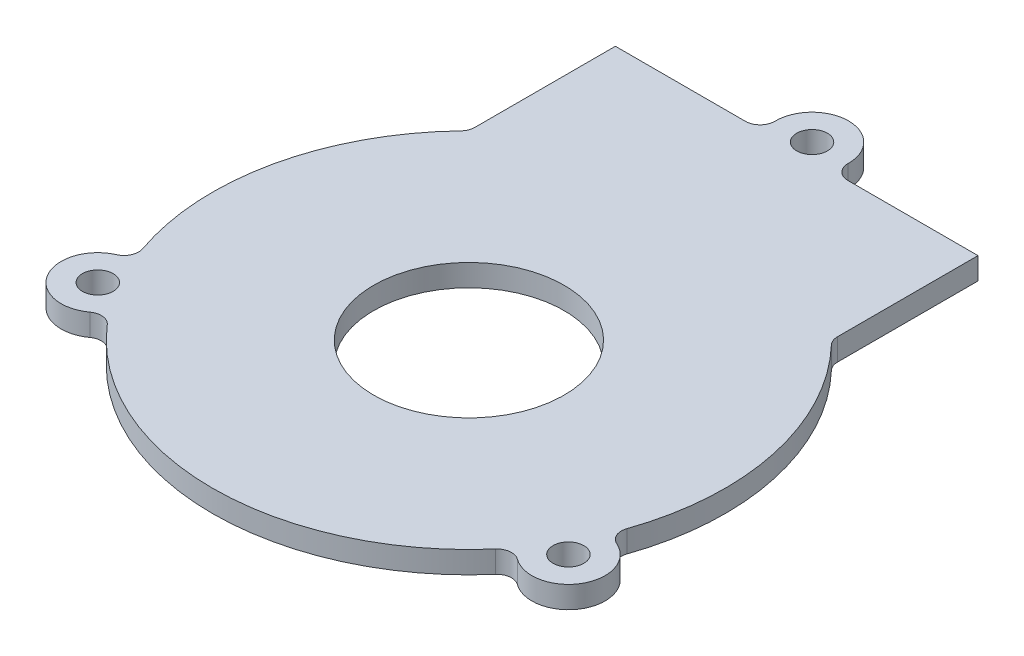
ISO-10303-21;
HEADER;
FILE_DESCRIPTION(('STEP AP214'),'2;1');
FILE_NAME('part.step','',(''),(''),'','','');
FILE_SCHEMA(('AUTOMOTIVE_DESIGN { 1 0 10303 214 1 1 1 1 }'));
ENDSEC;
DATA;
#1=APPLICATION_CONTEXT('core data for automotive mechanical design processes');
#2=APPLICATION_PROTOCOL_DEFINITION('international standard','automotive_design',2000,#1);
#3=PRODUCT_CONTEXT('',#1,'mechanical');
#4=PRODUCT('Part','Part','',(#3));
#5=PRODUCT_RELATED_PRODUCT_CATEGORY('part','',(#4));
#6=PRODUCT_DEFINITION_FORMATION('','',#4);
#7=PRODUCT_DEFINITION_CONTEXT('part definition',#1,'design');
#8=PRODUCT_DEFINITION('design','',#6,#7);
#9=PRODUCT_DEFINITION_SHAPE('','',#8);
#10=(LENGTH_UNIT() NAMED_UNIT(*) SI_UNIT(.MILLI.,.METRE.));
#11=(NAMED_UNIT(*) PLANE_ANGLE_UNIT() SI_UNIT($,.RADIAN.));
#12=(NAMED_UNIT(*) SI_UNIT($,.STERADIAN.) SOLID_ANGLE_UNIT());
#13=UNCERTAINTY_MEASURE_WITH_UNIT(LENGTH_MEASURE(1.E-05),#10,'distance_accuracy_value','');
#14=(GEOMETRIC_REPRESENTATION_CONTEXT(3) GLOBAL_UNCERTAINTY_ASSIGNED_CONTEXT((#13)) GLOBAL_UNIT_ASSIGNED_CONTEXT((#10,
#11,#12)) REPRESENTATION_CONTEXT('',''));
#15=CARTESIAN_POINT('',(0.,0.,0.));
#16=DIRECTION('',(0.,0.,1.));
#17=DIRECTION('',(1.,0.,0.));
#18=AXIS2_PLACEMENT_3D('',#15,#16,#17);
#19=CARTESIAN_POINT('',(0.,3.,0.));
#20=DIRECTION('',(0.,-1.,0.));
#21=DIRECTION('',(0.,0.,-1.));
#22=AXIS2_PLACEMENT_3D('',#19,#20,#21);
#23=CYLINDRICAL_SURFACE('',#22,35.);
#24=CARTESIAN_POINT('',(0.,0.,0.));
#25=DIRECTION('',(0.,1.,0.));
#26=DIRECTION('',(0.,0.,1.));
#27=AXIS2_PLACEMENT_3D('',#24,#25,#26);
#28=CIRCLE('',#27,35.);
#29=CARTESIAN_POINT('',(-25.3019754085747,0.,-24.1828459951239));
#30=VERTEX_POINT('',#29);
#31=CARTESIAN_POINT('',(-33.072840065109,0.,11.4537002766671));
#32=VERTEX_POINT('',#31);
#33=EDGE_CURVE('E211',#30,#32,#28,.T.);
#34=ORIENTED_EDGE('',*,*,#33,.T.);
#35=DIRECTION('',(0.,-1.,0.));
#36=VECTOR('',#35,1.);
#37=CARTESIAN_POINT('',(-33.072840065109,3.,11.4537002766671));
#38=LINE('',#37,#36);
#39=CARTESIAN_POINT('',(-33.072840065109,3.,11.4537002766671));
#40=VERTEX_POINT('',#39);
#41=EDGE_CURVE('E224',#32,#40,#38,.F.);
#42=ORIENTED_EDGE('',*,*,#41,.T.);
#43=CARTESIAN_POINT('',(0.,3.,0.));
#44=DIRECTION('',(0.,1.,0.));
#45=DIRECTION('',(0.,0.,1.));
#46=AXIS2_PLACEMENT_3D('',#43,#44,#45);
#47=CIRCLE('',#46,35.);
#48=CARTESIAN_POINT('',(-25.3019754085747,3.,-24.1828459951239));
#49=VERTEX_POINT('',#48);
#50=EDGE_CURVE('E205',#49,#40,#47,.T.);
#51=ORIENTED_EDGE('',*,*,#50,.F.);
#52=DIRECTION('',(0.,-1.,0.));
#53=VECTOR('',#52,1.);
#54=CARTESIAN_POINT('',(-25.3019754085747,3.,-24.1828459951239));
#55=LINE('',#54,#53);
#56=EDGE_CURVE('E218',#49,#30,#55,.T.);
#57=ORIENTED_EDGE('',*,*,#56,.T.);
#58=EDGE_LOOP('',(#34,#42,#51,#57));
#59=FACE_BOUND('',#58,.T.);
#60=ADVANCED_FACE('F43',(#59),#23,.T.);
#61=CARTESIAN_POINT('',(-26.5021889393046,0.,22.8611894140572));
#62=VERTEX_POINT('',#61);
#63=CARTESIAN_POINT('',(26.4887144081727,0.,22.8768006723464));
#64=VERTEX_POINT('',#63);
#65=EDGE_CURVE('E214',#62,#64,#28,.T.);
#66=ORIENTED_EDGE('',*,*,#65,.T.);
#67=DIRECTION('',(0.,-1.,0.));
#68=VECTOR('',#67,1.);
#69=CARTESIAN_POINT('',(26.4887144081727,3.,22.8768006723464));
#70=LINE('',#69,#68);
#71=CARTESIAN_POINT('',(26.4887144081727,3.,22.8768006723464));
#72=VERTEX_POINT('',#71);
#73=EDGE_CURVE('E243',#64,#72,#70,.F.);
#74=ORIENTED_EDGE('',*,*,#73,.T.);
#75=CARTESIAN_POINT('',(-26.5021889393046,3.,22.8611894140572));
#76=VERTEX_POINT('',#75);
#77=EDGE_CURVE('E209',#76,#72,#47,.T.);
#78=ORIENTED_EDGE('',*,*,#77,.F.);
#79=DIRECTION('',(0.,-1.,0.));
#80=VECTOR('',#79,1.);
#81=CARTESIAN_POINT('',(-26.5021889393046,3.,22.8611894140572));
#82=LINE('',#81,#80);
#83=EDGE_CURVE('E234',#76,#62,#82,.T.);
#84=ORIENTED_EDGE('',*,*,#83,.T.);
#85=EDGE_LOOP('',(#66,#74,#78,#84));
#86=FACE_BOUND('',#85,.T.);
#87=ADVANCED_FACE('F366',(#86),#23,.T.);
#88=CARTESIAN_POINT('',(-24.7478605121482,-53.381962685779,-44.7452325826062));
#89=DIRECTION('',(3.0206381024394E-06,0.,0.999999999995438));
#90=DIRECTION('',(0.999999999995438,0.,-3.0206381024394E-06));
#91=AXIS2_PLACEMENT_3D('',#88,#89,#90);
#92=PLANE('',#91);
#93=DIRECTION('',(0.999999999995438,0.,-3.0206381024394E-06));
#94=VECTOR('',#93,1.);
#95=CARTESIAN_POINT('',(-24.7478605121482,3.,-44.7452325826062));
#96=LINE('',#95,#94);
#97=CARTESIAN_POINT('',(-24.7478605121482,3.,-44.7452325826062));
#98=VERTEX_POINT('',#97);
#99=CARTESIAN_POINT('',(-6.99532394188785,3.,-44.7452862065945));
#100=VERTEX_POINT('',#99);
#101=EDGE_CURVE('E177',#98,#100,#96,.T.);
#102=ORIENTED_EDGE('',*,*,#101,.T.);
#103=DIRECTION('',(0.,1.,0.));
#104=VECTOR('',#103,1.);
#105=CARTESIAN_POINT('',(-6.99532394188785,-53.381962685779,-44.7452862065945));
#106=LINE('',#105,#104);
#107=CARTESIAN_POINT('',(-6.99532394188785,0.,-44.7452862065945));
#108=VERTEX_POINT('',#107);
#109=EDGE_CURVE('E278',#100,#108,#106,.F.);
#110=ORIENTED_EDGE('',*,*,#109,.T.);
#111=DIRECTION('',(-0.999999999995438,0.,3.0206381024394E-06));
#112=VECTOR('',#111,1.);
#113=CARTESIAN_POINT('',(-24.7478605121482,0.,-44.7452325826062));
#114=LINE('',#113,#112);
#115=CARTESIAN_POINT('',(-24.7478605121482,0.,-44.7452325826062));
#116=VERTEX_POINT('',#115);
#117=EDGE_CURVE('E198',#108,#116,#114,.T.);
#118=ORIENTED_EDGE('',*,*,#117,.T.);
#119=DIRECTION('',(0.,1.,0.));
#120=VECTOR('',#119,1.);
#121=CARTESIAN_POINT('',(-24.7478605121482,-53.381962685779,-44.7452325826062));
#122=LINE('',#121,#120);
#123=EDGE_CURVE('E194',#116,#98,#122,.T.);
#124=ORIENTED_EDGE('',*,*,#123,.T.);
#125=EDGE_LOOP('',(#102,#110,#118,#124));
#126=FACE_BOUND('',#125,.T.);
#127=ADVANCED_FACE('F284',(#126),#92,.F.);
#128=CARTESIAN_POINT('',(33.0630730181294,0.,11.4818640733046));
#129=VERTEX_POINT('',#128);
#130=CARTESIAN_POINT('',(25.3018293128609,0.,-24.1829988509046));
#131=VERTEX_POINT('',#130);
#132=EDGE_CURVE('E215',#129,#131,#28,.T.);
#133=ORIENTED_EDGE('',*,*,#132,.T.);
#134=DIRECTION('',(0.,-1.,0.));
#135=VECTOR('',#134,1.);
#136=CARTESIAN_POINT('',(25.3018293128609,3.,-24.1829988509046));
#137=LINE('',#136,#135);
#138=CARTESIAN_POINT('',(25.3018293128609,3.,-24.1829988509046));
#139=VERTEX_POINT('',#138);
#140=EDGE_CURVE('E262',#131,#139,#137,.F.);
#141=ORIENTED_EDGE('',*,*,#140,.T.);
#142=CARTESIAN_POINT('',(33.0630730181294,3.,11.4818640733046));
#143=VERTEX_POINT('',#142);
#144=EDGE_CURVE('E210',#143,#139,#47,.T.);
#145=ORIENTED_EDGE('',*,*,#144,.F.);
#146=DIRECTION('',(0.,-1.,0.));
#147=VECTOR('',#146,1.);
#148=CARTESIAN_POINT('',(33.0630730181294,3.,11.4818640733046));
#149=LINE('',#148,#147);
#150=EDGE_CURVE('E253',#143,#129,#149,.T.);
#151=ORIENTED_EDGE('',*,*,#150,.T.);
#152=EDGE_LOOP('',(#133,#141,#145,#151));
#153=FACE_BOUND('',#152,.T.);
#154=ADVANCED_FACE('F343',(#153),#23,.T.);
#155=CARTESIAN_POINT('',(0.,3.,0.));
#156=DIRECTION('',(0.,1.,0.));
#157=DIRECTION('',(0.,0.,1.));
#158=AXIS2_PLACEMENT_3D('',#155,#156,#157);
#159=PLANE('',#158);
#160=CARTESIAN_POINT('',(0.,3.,0.));
#161=DIRECTION('',(0.,1.,0.));
#162=DIRECTION('',(0.,0.,1.));
#163=AXIS2_PLACEMENT_3D('',#160,#161,#162);
#164=CIRCLE('',#163,13.);
#165=CARTESIAN_POINT('',(0.,3.,13.));
#166=VERTEX_POINT('',#165);
#167=EDGE_CURVE('E335',#166,#166,#164,.T.);
#168=ORIENTED_EDGE('',*,*,#167,.F.);
#169=EDGE_LOOP('',(#168));
#170=FACE_BOUND('',#169,.T.);
#171=CARTESIAN_POINT('',(-32.1480166138315,3.,18.5087961651664));
#172=DIRECTION('',(0.,1.,0.));
#173=DIRECTION('',(0.,0.,1.));
#174=AXIS2_PLACEMENT_3D('',#171,#172,#173);
#175=CIRCLE('',#174,2.09999999999999);
#176=CARTESIAN_POINT('',(-32.1480166138315,3.,20.6087961651664));
#177=VERTEX_POINT('',#176);
#178=EDGE_CURVE('E329',#177,#177,#175,.T.);
#179=ORIENTED_EDGE('',*,*,#178,.F.);
#180=EDGE_LOOP('',(#179));
#181=FACE_BOUND('',#180,.T.);
#182=DIRECTION('',(-3.02063810260161E-06,0.,-0.999999999995438));
#183=VECTOR('',#182,1.);
#184=CARTESIAN_POINT('',(-24.7478001128037,3.,-24.7496745347634));
#185=LINE('',#184,#183);
#186=CARTESIAN_POINT('',(-24.7478025747881,3.,-25.5647289504072));
#187=VERTEX_POINT('',#186);
#188=EDGE_CURVE('E195',#187,#98,#185,.T.);
#189=ORIENTED_EDGE('',*,*,#188,.F.);
#190=CARTESIAN_POINT('',(-26.747802574779,3.,-25.564722909131));
#191=DIRECTION('',(0.,1.,0.));
#192=DIRECTION('',(0.,0.,1.));
#193=AXIS2_PLACEMENT_3D('',#190,#191,#192);
#194=CIRCLE('',#193,2.);
#195=EDGE_CURVE('E220',#187,#49,#194,.F.);
#196=ORIENTED_EDGE('',*,*,#195,.T.);
#197=ORIENTED_EDGE('',*,*,#50,.T.);
#198=CARTESIAN_POINT('',(-34.9627166402581,3.,12.1081974353338));
#199=DIRECTION('',(0.,1.,0.));
#200=DIRECTION('',(0.,0.,1.));
#201=AXIS2_PLACEMENT_3D('',#198,#199,#200);
#202=CIRCLE('',#201,2.);
#203=CARTESIAN_POINT('',(-34.1580179965192,3.,13.9391698799011));
#204=VERTEX_POINT('',#203);
#205=EDGE_CURVE('E230',#40,#204,#202,.F.);
#206=ORIENTED_EDGE('',*,*,#205,.T.);
#207=CARTESIAN_POINT('',(-32.1464555555357,3.,18.5161819435163));
#208=DIRECTION('',(0.,1.,0.));
#209=DIRECTION('',(0.,0.,1.));
#210=AXIS2_PLACEMENT_3D('',#207,#208,#209);
#211=CIRCLE('',#210,4.99954226749351);
#212=CARTESIAN_POINT('',(-29.1966357044392,3.,22.5527628891349));
#213=VERTEX_POINT('',#212);
#214=EDGE_CURVE('E323',#204,#213,#211,.T.);
#215=ORIENTED_EDGE('',*,*,#214,.T.);
#216=CARTESIAN_POINT('',(-28.0165997358363,3.,24.1675430948605));
#217=DIRECTION('',(0.,1.,0.));
#218=DIRECTION('',(0.,0.,1.));
#219=AXIS2_PLACEMENT_3D('',#216,#217,#218);
#220=CIRCLE('',#219,2.);
#221=EDGE_CURVE('E241',#213,#76,#220,.F.);
#222=ORIENTED_EDGE('',*,*,#221,.T.);
#223=ORIENTED_EDGE('',*,*,#77,.T.);
#224=CARTESIAN_POINT('',(28.0023552314968,3.,24.1840464250519));
#225=DIRECTION('',(0.,1.,0.));
#226=DIRECTION('',(0.,0.,1.));
#227=AXIS2_PLACEMENT_3D('',#224,#225,#226);
#228=CIRCLE('',#227,2.);
#229=CARTESIAN_POINT('',(29.184359284545,3.,22.5707062815676));
#230=VERTEX_POINT('',#229);
#231=EDGE_CURVE('E249',#72,#230,#228,.F.);
#232=ORIENTED_EDGE('',*,*,#231,.T.);
#233=CARTESIAN_POINT('',(32.1364886347761,3.,18.5412879583363));
#234=DIRECTION('',(0.,1.,0.));
#235=DIRECTION('',(0.,0.,1.));
#236=AXIS2_PLACEMENT_3D('',#233,#234,#235);
#237=CIRCLE('',#236,4.9951255964279);
#238=CARTESIAN_POINT('',(34.147287178261,3.,13.9687647007018));
#239=VERTEX_POINT('',#238);
#240=EDGE_CURVE('E312',#230,#239,#237,.T.);
#241=ORIENTED_EDGE('',*,*,#240,.T.);
#242=CARTESIAN_POINT('',(34.9523914763083,3.,12.1379705917791));
#243=DIRECTION('',(0.,1.,0.));
#244=DIRECTION('',(0.,0.,1.));
#245=AXIS2_PLACEMENT_3D('',#242,#243,#244);
#246=CIRCLE('',#245,2.);
#247=EDGE_CURVE('E260',#239,#143,#246,.F.);
#248=ORIENTED_EDGE('',*,*,#247,.T.);
#249=ORIENTED_EDGE('',*,*,#144,.T.);
#250=CARTESIAN_POINT('',(26.7476481307387,3.,-25.5648844995277));
#251=DIRECTION('',(0.,1.,0.));
#252=DIRECTION('',(0.,0.,1.));
#253=AXIS2_PLACEMENT_3D('',#250,#251,#252);
#254=CIRCLE('',#253,2.);
#255=CARTESIAN_POINT('',(24.7476481307478,3.,-25.5648784582515));
#256=VERTEX_POINT('',#255);
#257=EDGE_CURVE('E185',#139,#256,#254,.F.);
#258=ORIENTED_EDGE('',*,*,#257,.T.);
#259=DIRECTION('',(-3.02063810260161E-06,0.,-0.999999999995438));
#260=VECTOR('',#259,1.);
#261=CARTESIAN_POINT('',(24.7476505927322,3.,-24.7498240426077));
#262=LINE('',#261,#260);
#263=CARTESIAN_POINT('',(24.7475901933877,3.,-44.7453820904505));
#264=VERTEX_POINT('',#263);
#265=EDGE_CURVE('E178',#256,#264,#262,.T.);
#266=ORIENTED_EDGE('',*,*,#265,.T.);
#267=CARTESIAN_POINT('',(6.99533660471705,3.,-44.7453284673169));
#268=VERTEX_POINT('',#267);
#269=EDGE_CURVE('E168',#268,#264,#96,.T.);
#270=ORIENTED_EDGE('',*,*,#269,.F.);
#271=CARTESIAN_POINT('',(6.99533056344084,3.,-46.7453284673078));
#272=DIRECTION('',(0.,1.,0.));
#273=DIRECTION('',(0.,0.,1.));
#274=AXIS2_PLACEMENT_3D('',#271,#272,#273);
#275=CIRCLE('',#274,2.);
#276=CARTESIAN_POINT('',(4.99551899083441,3.,-46.7727815922561));
#277=VERTEX_POINT('',#276);
#278=EDGE_CURVE('E274',#268,#277,#275,.F.);
#279=ORIENTED_EDGE('',*,*,#278,.T.);
#280=CARTESIAN_POINT('',(0.,3.,-46.8413593567393));
#281=DIRECTION('',(0.,1.,0.));
#282=DIRECTION('',(0.,0.,1.));
#283=AXIS2_PLACEMENT_3D('',#280,#281,#282);
#284=CIRCLE('',#283,4.99598968149142);
#285=CARTESIAN_POINT('',(-4.99551857644603,3.,-46.7727514129473));
#286=VERTEX_POINT('',#285);
#287=EDGE_CURVE('E304',#277,#286,#284,.T.);
#288=ORIENTED_EDGE('',*,*,#287,.T.);
#289=CARTESIAN_POINT('',(-6.99532998316405,3.,-46.7452862065854));
#290=DIRECTION('',(0.,1.,0.));
#291=DIRECTION('',(0.,0.,1.));
#292=AXIS2_PLACEMENT_3D('',#289,#290,#291);
#293=CIRCLE('',#292,2.);
#294=EDGE_CURVE('E12',#286,#100,#293,.F.);
#295=ORIENTED_EDGE('',*,*,#294,.T.);
#296=ORIENTED_EDGE('',*,*,#101,.F.);
#297=EDGE_LOOP('',(#189,#196,#197,#206,#215,#222,#223,#232,#241,#248,#249,#258,#266,#270,#279,
#288,#295,#296));
#298=FACE_BOUND('',#297,.T.);
#299=CARTESIAN_POINT('',(32.1247811991366,3.,18.5356173256723));
#300=DIRECTION('',(0.,1.,0.));
#301=DIRECTION('',(0.,0.,1.));
#302=AXIS2_PLACEMENT_3D('',#299,#300,#301);
#303=CIRCLE('',#302,2.1);
#304=CARTESIAN_POINT('',(32.1247811991366,3.,20.6356173256723));
#305=VERTEX_POINT('',#304);
#306=EDGE_CURVE('E318',#305,#305,#303,.T.);
#307=ORIENTED_EDGE('',*,*,#306,.F.);
#308=EDGE_LOOP('',(#307));
#309=FACE_BOUND('',#308,.T.);
#310=CARTESIAN_POINT('',(0.,3.,-46.8413593567393));
#311=DIRECTION('',(0.,1.,0.));
#312=DIRECTION('',(0.,0.,1.));
#313=AXIS2_PLACEMENT_3D('',#310,#311,#312);
#314=CIRCLE('',#313,2.09605202456873);
#315=CARTESIAN_POINT('',(0.,3.,-44.7453073321706));
#316=VERTEX_POINT('',#315);
#317=EDGE_CURVE('E306',#316,#316,#314,.T.);
#318=ORIENTED_EDGE('',*,*,#317,.F.);
#319=EDGE_LOOP('',(#318));
#320=FACE_BOUND('',#319,.T.);
#321=ADVANCED_FACE('F182',(#170,#181,#298,#309,#320),#159,.T.);
#322=CARTESIAN_POINT('',(0.,0.,0.));
#323=DIRECTION('',(0.,1.,0.));
#324=DIRECTION('',(0.,0.,1.));
#325=AXIS2_PLACEMENT_3D('',#322,#323,#324);
#326=PLANE('',#325);
#327=CARTESIAN_POINT('',(0.,0.,0.));
#328=DIRECTION('',(0.,1.,0.));
#329=DIRECTION('',(0.,0.,1.));
#330=AXIS2_PLACEMENT_3D('',#327,#328,#329);
#331=CIRCLE('',#330,13.);
#332=CARTESIAN_POINT('',(0.,0.,13.));
#333=VERTEX_POINT('',#332);
#334=EDGE_CURVE('E332',#333,#333,#331,.F.);
#335=ORIENTED_EDGE('',*,*,#334,.F.);
#336=EDGE_LOOP('',(#335));
#337=FACE_BOUND('',#336,.T.);
#338=CARTESIAN_POINT('',(-32.1480166138315,0.,18.5087961651664));
#339=DIRECTION('',(0.,1.,0.));
#340=DIRECTION('',(0.,0.,1.));
#341=AXIS2_PLACEMENT_3D('',#338,#339,#340);
#342=CIRCLE('',#341,2.1);
#343=CARTESIAN_POINT('',(-32.1480166138315,0.,20.6087961651664));
#344=VERTEX_POINT('',#343);
#345=EDGE_CURVE('E326',#344,#344,#342,.T.);
#346=ORIENTED_EDGE('',*,*,#345,.T.);
#347=EDGE_LOOP('',(#346));
#348=FACE_BOUND('',#347,.T.);
#349=CARTESIAN_POINT('',(32.1247811991366,0.,18.5356173256723));
#350=DIRECTION('',(0.,1.,0.));
#351=DIRECTION('',(0.,0.,1.));
#352=AXIS2_PLACEMENT_3D('',#349,#350,#351);
#353=CIRCLE('',#352,2.1);
#354=CARTESIAN_POINT('',(32.1247811991366,0.,20.6356173256723));
#355=VERTEX_POINT('',#354);
#356=EDGE_CURVE('E315',#355,#355,#353,.T.);
#357=ORIENTED_EDGE('',*,*,#356,.T.);
#358=EDGE_LOOP('',(#357));
#359=FACE_BOUND('',#358,.T.);
#360=CARTESIAN_POINT('',(0.,0.,-46.8413593567393));
#361=DIRECTION('',(0.,1.,0.));
#362=DIRECTION('',(0.,0.,1.));
#363=AXIS2_PLACEMENT_3D('',#360,#361,#362);
#364=CIRCLE('',#363,2.09605202456873);
#365=CARTESIAN_POINT('',(0.,0.,-44.7453073321706));
#366=VERTEX_POINT('',#365);
#367=EDGE_CURVE('E188',#366,#366,#364,.F.);
#368=ORIENTED_EDGE('',*,*,#367,.F.);
#369=EDGE_LOOP('',(#368));
#370=FACE_BOUND('',#369,.T.);
#371=ORIENTED_EDGE('',*,*,#65,.F.);
#372=CARTESIAN_POINT('',(-28.0165997358363,0.,24.1675430948605));
#373=DIRECTION('',(0.,1.,0.));
#374=DIRECTION('',(0.,0.,1.));
#375=AXIS2_PLACEMENT_3D('',#372,#373,#374);
#376=CIRCLE('',#375,2.);
#377=CARTESIAN_POINT('',(-29.1966357044392,0.,22.5527628891349));
#378=VERTEX_POINT('',#377);
#379=EDGE_CURVE('E239',#62,#378,#376,.T.);
#380=ORIENTED_EDGE('',*,*,#379,.T.);
#381=CARTESIAN_POINT('',(-32.1464555555357,0.,18.5161819435163));
#382=DIRECTION('',(0.,1.,0.));
#383=DIRECTION('',(0.,0.,1.));
#384=AXIS2_PLACEMENT_3D('',#381,#382,#383);
#385=CIRCLE('',#384,4.99954226749351);
#386=CARTESIAN_POINT('',(-34.1580179965192,0.,13.9391698799011));
#387=VERTEX_POINT('',#386);
#388=EDGE_CURVE('E321',#378,#387,#385,.F.);
#389=ORIENTED_EDGE('',*,*,#388,.T.);
#390=CARTESIAN_POINT('',(-34.9627166402581,0.,12.1081974353338));
#391=DIRECTION('',(0.,1.,0.));
#392=DIRECTION('',(0.,0.,1.));
#393=AXIS2_PLACEMENT_3D('',#390,#391,#392);
#394=CIRCLE('',#393,2.);
#395=EDGE_CURVE('E232',#387,#32,#394,.T.);
#396=ORIENTED_EDGE('',*,*,#395,.T.);
#397=ORIENTED_EDGE('',*,*,#33,.F.);
#398=CARTESIAN_POINT('',(-26.747802574779,0.,-25.564722909131));
#399=DIRECTION('',(0.,1.,0.));
#400=DIRECTION('',(0.,0.,1.));
#401=AXIS2_PLACEMENT_3D('',#398,#399,#400);
#402=CIRCLE('',#401,2.);
#403=CARTESIAN_POINT('',(-24.7478025747881,0.,-25.5647289504072));
#404=VERTEX_POINT('',#403);
#405=EDGE_CURVE('E222',#30,#404,#402,.T.);
#406=ORIENTED_EDGE('',*,*,#405,.T.);
#407=DIRECTION('',(3.02063810260161E-06,0.,0.999999999995438));
#408=VECTOR('',#407,1.);
#409=CARTESIAN_POINT('',(-24.7478001128037,0.,-24.7496745347634));
#410=LINE('',#409,#408);
#411=EDGE_CURVE('E204',#116,#404,#410,.T.);
#412=ORIENTED_EDGE('',*,*,#411,.F.);
#413=ORIENTED_EDGE('',*,*,#117,.F.);
#414=CARTESIAN_POINT('',(-6.99532998316405,0.,-46.7452862065854));
#415=DIRECTION('',(0.,1.,0.));
#416=DIRECTION('',(0.,0.,1.));
#417=AXIS2_PLACEMENT_3D('',#414,#415,#416);
#418=CIRCLE('',#417,2.);
#419=CARTESIAN_POINT('',(-4.99551857644603,0.,-46.7727514129473));
#420=VERTEX_POINT('',#419);
#421=EDGE_CURVE('E51',#108,#420,#418,.T.);
#422=ORIENTED_EDGE('',*,*,#421,.T.);
#423=CARTESIAN_POINT('',(0.,0.,-46.8413593567393));
#424=DIRECTION('',(0.,1.,0.));
#425=DIRECTION('',(0.,0.,1.));
#426=AXIS2_PLACEMENT_3D('',#423,#424,#425);
#427=CIRCLE('',#426,4.99598968149142);
#428=CARTESIAN_POINT('',(4.99551899083441,0.,-46.7727815922561));
#429=VERTEX_POINT('',#428);
#430=EDGE_CURVE('E303',#420,#429,#427,.F.);
#431=ORIENTED_EDGE('',*,*,#430,.T.);
#432=CARTESIAN_POINT('',(6.99533056344084,0.,-46.7453284673078));
#433=DIRECTION('',(0.,1.,0.));
#434=DIRECTION('',(0.,0.,1.));
#435=AXIS2_PLACEMENT_3D('',#432,#433,#434);
#436=CIRCLE('',#435,2.);
#437=CARTESIAN_POINT('',(6.99533660471705,0.,-44.7453284673169));
#438=VERTEX_POINT('',#437);
#439=EDGE_CURVE('E276',#429,#438,#436,.T.);
#440=ORIENTED_EDGE('',*,*,#439,.T.);
#441=CARTESIAN_POINT('',(24.7475901933877,0.,-44.7453820904505));
#442=VERTEX_POINT('',#441);
#443=EDGE_CURVE('E202',#442,#438,#114,.T.);
#444=ORIENTED_EDGE('',*,*,#443,.F.);
#445=DIRECTION('',(3.02063810260161E-06,0.,0.999999999995438));
#446=VECTOR('',#445,1.);
#447=CARTESIAN_POINT('',(24.7476505927322,0.,-24.7498240426077));
#448=LINE('',#447,#446);
#449=CARTESIAN_POINT('',(24.7476481307478,0.,-25.5648784582515));
#450=VERTEX_POINT('',#449);
#451=EDGE_CURVE('E193',#442,#450,#448,.T.);
#452=ORIENTED_EDGE('',*,*,#451,.T.);
#453=CARTESIAN_POINT('',(26.7476481307387,0.,-25.5648844995277));
#454=DIRECTION('',(0.,1.,0.));
#455=DIRECTION('',(0.,0.,1.));
#456=AXIS2_PLACEMENT_3D('',#453,#454,#455);
#457=CIRCLE('',#456,2.);
#458=EDGE_CURVE('E268',#450,#131,#457,.T.);
#459=ORIENTED_EDGE('',*,*,#458,.T.);
#460=ORIENTED_EDGE('',*,*,#132,.F.);
#461=CARTESIAN_POINT('',(34.9523914763083,0.,12.1379705917791));
#462=DIRECTION('',(0.,1.,0.));
#463=DIRECTION('',(0.,0.,1.));
#464=AXIS2_PLACEMENT_3D('',#461,#462,#463);
#465=CIRCLE('',#464,2.);
#466=CARTESIAN_POINT('',(34.147287178261,0.,13.9687647007018));
#467=VERTEX_POINT('',#466);
#468=EDGE_CURVE('E258',#129,#467,#465,.T.);
#469=ORIENTED_EDGE('',*,*,#468,.T.);
#470=CARTESIAN_POINT('',(32.1364886347761,0.,18.5412879583363));
#471=DIRECTION('',(0.,1.,0.));
#472=DIRECTION('',(0.,0.,1.));
#473=AXIS2_PLACEMENT_3D('',#470,#471,#472);
#474=CIRCLE('',#473,4.9951255964279);
#475=CARTESIAN_POINT('',(29.184359284545,0.,22.5707062815676));
#476=VERTEX_POINT('',#475);
#477=EDGE_CURVE('E309',#467,#476,#474,.F.);
#478=ORIENTED_EDGE('',*,*,#477,.T.);
#479=CARTESIAN_POINT('',(28.0023552314968,0.,24.1840464250519));
#480=DIRECTION('',(0.,1.,0.));
#481=DIRECTION('',(0.,0.,1.));
#482=AXIS2_PLACEMENT_3D('',#479,#480,#481);
#483=CIRCLE('',#482,2.);
#484=EDGE_CURVE('E251',#476,#64,#483,.T.);
#485=ORIENTED_EDGE('',*,*,#484,.T.);
#486=EDGE_LOOP('',(#371,#380,#389,#396,#397,#406,#412,#413,#422,#431,#440,#444,#452,#459,#460,
#469,#478,#485));
#487=FACE_BOUND('',#486,.T.);
#488=ADVANCED_FACE('F290',(#337,#348,#359,#370,#487),#326,.F.);
#489=ORIENTED_EDGE('',*,*,#443,.T.);
#490=DIRECTION('',(0.,1.,0.));
#491=VECTOR('',#490,1.);
#492=CARTESIAN_POINT('',(6.99533660471705,-53.381962685779,-44.7453284673169));
#493=LINE('',#492,#491);
#494=EDGE_CURVE('E175',#438,#268,#493,.T.);
#495=ORIENTED_EDGE('',*,*,#494,.T.);
#496=ORIENTED_EDGE('',*,*,#269,.T.);
#497=DIRECTION('',(0.,1.,0.));
#498=VECTOR('',#497,1.);
#499=CARTESIAN_POINT('',(24.7475901933877,-53.381962685779,-44.7453820904505));
#500=LINE('',#499,#498);
#501=EDGE_CURVE('E173',#442,#264,#500,.T.);
#502=ORIENTED_EDGE('',*,*,#501,.F.);
#503=EDGE_LOOP('',(#489,#495,#496,#502));
#504=FACE_BOUND('',#503,.T.);
#505=ADVANCED_FACE('F171',(#504),#92,.F.);
#506=CARTESIAN_POINT('',(-24.7478001128037,-53.381962685779,-24.7496745347634));
#507=DIRECTION('',(0.999999999995438,0.,-3.02063810260161E-06));
#508=DIRECTION('',(-3.02063810260161E-06,0.,-0.999999999995438));
#509=AXIS2_PLACEMENT_3D('',#506,#507,#508);
#510=PLANE('',#509);
#511=ORIENTED_EDGE('',*,*,#411,.T.);
#512=DIRECTION('',(0.,1.,0.));
#513=VECTOR('',#512,1.);
#514=CARTESIAN_POINT('',(-24.7478025747881,3.,-25.5647289504072));
#515=LINE('',#514,#513);
#516=EDGE_CURVE('E208',#404,#187,#515,.T.);
#517=ORIENTED_EDGE('',*,*,#516,.T.);
#518=ORIENTED_EDGE('',*,*,#188,.T.);
#519=ORIENTED_EDGE('',*,*,#123,.F.);
#520=EDGE_LOOP('',(#511,#517,#518,#519));
#521=FACE_BOUND('',#520,.T.);
#522=ADVANCED_FACE('F298',(#521),#510,.F.);
#523=CARTESIAN_POINT('',(24.7476505927322,-53.381962685779,-24.7498240426077));
#524=DIRECTION('',(0.999999999995438,0.,-3.02063810260161E-06));
#525=DIRECTION('',(-3.02063810260161E-06,0.,-0.999999999995438));
#526=AXIS2_PLACEMENT_3D('',#523,#524,#525);
#527=PLANE('',#526);
#528=ORIENTED_EDGE('',*,*,#265,.F.);
#529=DIRECTION('',(0.,-1.,0.));
#530=VECTOR('',#529,1.);
#531=CARTESIAN_POINT('',(24.7476481307478,-53.381962685779,-25.5648784582515));
#532=LINE('',#531,#530);
#533=EDGE_CURVE('E265',#256,#450,#532,.T.);
#534=ORIENTED_EDGE('',*,*,#533,.T.);
#535=ORIENTED_EDGE('',*,*,#451,.F.);
#536=ORIENTED_EDGE('',*,*,#501,.T.);
#537=EDGE_LOOP('',(#528,#534,#535,#536));
#538=FACE_BOUND('',#537,.T.);
#539=ADVANCED_FACE('F191',(#538),#527,.T.);
#540=CARTESIAN_POINT('',(0.,-14.1307927300824,-46.8413593567393));
#541=DIRECTION('',(0.,1.,0.));
#542=DIRECTION('',(0.,0.,1.));
#543=AXIS2_PLACEMENT_3D('',#540,#541,#542);
#544=CYLINDRICAL_SURFACE('',#543,4.99598968149142);
#545=ORIENTED_EDGE('',*,*,#430,.F.);
#546=DIRECTION('',(0.,1.,0.));
#547=VECTOR('',#546,1.);
#548=CARTESIAN_POINT('',(-4.99551857644604,-14.1307927300824,-46.7727514129473));
#549=LINE('',#548,#547);
#550=EDGE_CURVE('E64',#420,#286,#549,.T.);
#551=ORIENTED_EDGE('',*,*,#550,.T.);
#552=ORIENTED_EDGE('',*,*,#287,.F.);
#553=DIRECTION('',(0.,1.,0.));
#554=VECTOR('',#553,1.);
#555=CARTESIAN_POINT('',(4.99551899083441,-14.1307927300824,-46.7727815922561));
#556=LINE('',#555,#554);
#557=EDGE_CURVE('E271',#277,#429,#556,.F.);
#558=ORIENTED_EDGE('',*,*,#557,.T.);
#559=EDGE_LOOP('',(#545,#551,#552,#558));
#560=FACE_BOUND('',#559,.T.);
#561=ADVANCED_FACE('F392',(#560),#544,.T.);
#562=CARTESIAN_POINT('',(0.,-14.1307927300824,-46.8413593567393));
#563=DIRECTION('',(0.,1.,0.));
#564=DIRECTION('',(0.,0.,1.));
#565=AXIS2_PLACEMENT_3D('',#562,#563,#564);
#566=CYLINDRICAL_SURFACE('',#565,2.09605202456873);
#567=ORIENTED_EDGE('',*,*,#317,.T.);
#568=EDGE_LOOP('',(#567));
#569=FACE_BOUND('',#568,.T.);
#570=ORIENTED_EDGE('',*,*,#367,.T.);
#571=EDGE_LOOP('',(#570));
#572=FACE_BOUND('',#571,.T.);
#573=ADVANCED_FACE('F443',(#569,#572),#566,.F.);
#574=CARTESIAN_POINT('',(32.1364886347761,-14.1283487284507,18.5412879583363));
#575=DIRECTION('',(0.,1.,0.));
#576=DIRECTION('',(0.,0.,1.));
#577=AXIS2_PLACEMENT_3D('',#574,#575,#576);
#578=CYLINDRICAL_SURFACE('',#577,4.9951255964279);
#579=ORIENTED_EDGE('',*,*,#477,.F.);
#580=DIRECTION('',(0.,1.,0.));
#581=VECTOR('',#580,1.);
#582=CARTESIAN_POINT('',(34.147287178261,-14.1283487284507,13.9687647007018));
#583=LINE('',#582,#581);
#584=EDGE_CURVE('E256',#467,#239,#583,.T.);
#585=ORIENTED_EDGE('',*,*,#584,.T.);
#586=ORIENTED_EDGE('',*,*,#240,.F.);
#587=DIRECTION('',(0.,1.,0.));
#588=VECTOR('',#587,1.);
#589=CARTESIAN_POINT('',(29.184359284545,-14.1283487284507,22.5707062815676));
#590=LINE('',#589,#588);
#591=EDGE_CURVE('E246',#230,#476,#590,.F.);
#592=ORIENTED_EDGE('',*,*,#591,.T.);
#593=EDGE_LOOP('',(#579,#585,#586,#592));
#594=FACE_BOUND('',#593,.T.);
#595=ADVANCED_FACE('F438',(#594),#578,.T.);
#596=CARTESIAN_POINT('',(32.1247811991366,3.,18.5356173256723));
#597=DIRECTION('',(0.,1.,0.));
#598=DIRECTION('',(0.,0.,1.));
#599=AXIS2_PLACEMENT_3D('',#596,#597,#598);
#600=CYLINDRICAL_SURFACE('',#599,2.1);
#601=ORIENTED_EDGE('',*,*,#356,.F.);
#602=EDGE_LOOP('',(#601));
#603=FACE_BOUND('',#602,.T.);
#604=ORIENTED_EDGE('',*,*,#306,.T.);
#605=EDGE_LOOP('',(#604));
#606=FACE_BOUND('',#605,.T.);
#607=ADVANCED_FACE('F360',(#603,#606),#600,.F.);
#608=CARTESIAN_POINT('',(-32.1464555555357,-14.1408409606937,18.5161819435163));
#609=DIRECTION('',(0.,1.,0.));
#610=DIRECTION('',(0.,0.,1.));
#611=AXIS2_PLACEMENT_3D('',#608,#609,#610);
#612=CYLINDRICAL_SURFACE('',#611,4.99954226749351);
#613=ORIENTED_EDGE('',*,*,#388,.F.);
#614=DIRECTION('',(0.,1.,0.));
#615=VECTOR('',#614,1.);
#616=CARTESIAN_POINT('',(-29.1966357044392,-14.1408409606937,22.5527628891349));
#617=LINE('',#616,#615);
#618=EDGE_CURVE('E237',#378,#213,#617,.T.);
#619=ORIENTED_EDGE('',*,*,#618,.T.);
#620=ORIENTED_EDGE('',*,*,#214,.F.);
#621=DIRECTION('',(0.,1.,0.));
#622=VECTOR('',#621,1.);
#623=CARTESIAN_POINT('',(-34.1580179965192,-14.1408409606937,13.9391698799011));
#624=LINE('',#623,#622);
#625=EDGE_CURVE('E227',#204,#387,#624,.F.);
#626=ORIENTED_EDGE('',*,*,#625,.T.);
#627=EDGE_LOOP('',(#613,#619,#620,#626));
#628=FACE_BOUND('',#627,.T.);
#629=ADVANCED_FACE('F350',(#628),#612,.T.);
#630=CARTESIAN_POINT('',(-32.1480166138315,3.,18.5087961651664));
#631=DIRECTION('',(0.,1.,0.));
#632=DIRECTION('',(0.,0.,1.));
#633=AXIS2_PLACEMENT_3D('',#630,#631,#632);
#634=CYLINDRICAL_SURFACE('',#633,2.09999999999999);
#635=ORIENTED_EDGE('',*,*,#345,.F.);
#636=EDGE_LOOP('',(#635));
#637=FACE_BOUND('',#636,.T.);
#638=ORIENTED_EDGE('',*,*,#178,.T.);
#639=EDGE_LOOP('',(#638));
#640=FACE_BOUND('',#639,.T.);
#641=ADVANCED_FACE('F347',(#637,#640),#634,.F.);
#642=CARTESIAN_POINT('',(-26.747802574779,3.,-25.564722909131));
#643=DIRECTION('',(0.,-1.,0.));
#644=DIRECTION('',(0.,0.,-1.));
#645=AXIS2_PLACEMENT_3D('',#642,#643,#644);
#646=CYLINDRICAL_SURFACE('',#645,2.);
#647=ORIENTED_EDGE('',*,*,#405,.F.);
#648=ORIENTED_EDGE('',*,*,#56,.F.);
#649=ORIENTED_EDGE('',*,*,#195,.F.);
#650=ORIENTED_EDGE('',*,*,#516,.F.);
#651=EDGE_LOOP('',(#647,#648,#649,#650));
#652=FACE_BOUND('',#651,.T.);
#653=ADVANCED_FACE('F349',(#652),#646,.F.);
#654=CARTESIAN_POINT('',(-34.9627166402581,-14.1408409606937,12.1081974353338));
#655=DIRECTION('',(0.,-1.,0.));
#656=DIRECTION('',(0.,0.,-1.));
#657=AXIS2_PLACEMENT_3D('',#654,#655,#656);
#658=CYLINDRICAL_SURFACE('',#657,2.);
#659=ORIENTED_EDGE('',*,*,#395,.F.);
#660=ORIENTED_EDGE('',*,*,#625,.F.);
#661=ORIENTED_EDGE('',*,*,#205,.F.);
#662=ORIENTED_EDGE('',*,*,#41,.F.);
#663=EDGE_LOOP('',(#659,#660,#661,#662));
#664=FACE_BOUND('',#663,.T.);
#665=ADVANCED_FACE('F357',(#664),#658,.F.);
#666=CARTESIAN_POINT('',(-28.0165997358363,-14.1408409606937,24.1675430948605));
#667=DIRECTION('',(0.,1.,0.));
#668=DIRECTION('',(0.,0.,1.));
#669=AXIS2_PLACEMENT_3D('',#666,#667,#668);
#670=CYLINDRICAL_SURFACE('',#669,2.);
#671=ORIENTED_EDGE('',*,*,#221,.F.);
#672=ORIENTED_EDGE('',*,*,#618,.F.);
#673=ORIENTED_EDGE('',*,*,#379,.F.);
#674=ORIENTED_EDGE('',*,*,#83,.F.);
#675=EDGE_LOOP('',(#671,#672,#673,#674));
#676=FACE_BOUND('',#675,.T.);
#677=ADVANCED_FACE('F411',(#676),#670,.F.);
#678=CARTESIAN_POINT('',(28.0023552314968,-14.1283487284507,24.1840464250519));
#679=DIRECTION('',(0.,-1.,0.));
#680=DIRECTION('',(0.,0.,-1.));
#681=AXIS2_PLACEMENT_3D('',#678,#679,#680);
#682=CYLINDRICAL_SURFACE('',#681,2.);
#683=ORIENTED_EDGE('',*,*,#484,.F.);
#684=ORIENTED_EDGE('',*,*,#591,.F.);
#685=ORIENTED_EDGE('',*,*,#231,.F.);
#686=ORIENTED_EDGE('',*,*,#73,.F.);
#687=EDGE_LOOP('',(#683,#684,#685,#686));
#688=FACE_BOUND('',#687,.T.);
#689=ADVANCED_FACE('F407',(#688),#682,.F.);
#690=CARTESIAN_POINT('',(34.9523914763083,-14.1283487284507,12.1379705917791));
#691=DIRECTION('',(0.,1.,0.));
#692=DIRECTION('',(0.,0.,1.));
#693=AXIS2_PLACEMENT_3D('',#690,#691,#692);
#694=CYLINDRICAL_SURFACE('',#693,2.);
#695=ORIENTED_EDGE('',*,*,#247,.F.);
#696=ORIENTED_EDGE('',*,*,#584,.F.);
#697=ORIENTED_EDGE('',*,*,#468,.F.);
#698=ORIENTED_EDGE('',*,*,#150,.F.);
#699=EDGE_LOOP('',(#695,#696,#697,#698));
#700=FACE_BOUND('',#699,.T.);
#701=ADVANCED_FACE('F402',(#700),#694,.F.);
#702=CARTESIAN_POINT('',(26.7476481307387,3.,-25.5648844995277));
#703=DIRECTION('',(0.,-1.,0.));
#704=DIRECTION('',(0.,0.,-1.));
#705=AXIS2_PLACEMENT_3D('',#702,#703,#704);
#706=CYLINDRICAL_SURFACE('',#705,2.);
#707=ORIENTED_EDGE('',*,*,#458,.F.);
#708=ORIENTED_EDGE('',*,*,#533,.F.);
#709=ORIENTED_EDGE('',*,*,#257,.F.);
#710=ORIENTED_EDGE('',*,*,#140,.F.);
#711=EDGE_LOOP('',(#707,#708,#709,#710));
#712=FACE_BOUND('',#711,.T.);
#713=ADVANCED_FACE('F387',(#712),#706,.F.);
#714=CARTESIAN_POINT('',(6.99533056344084,-14.1307927300824,-46.7453284673078));
#715=DIRECTION('',(0.,1.,0.));
#716=DIRECTION('',(0.,0.,1.));
#717=AXIS2_PLACEMENT_3D('',#714,#715,#716);
#718=CYLINDRICAL_SURFACE('',#717,2.);
#719=ORIENTED_EDGE('',*,*,#439,.F.);
#720=ORIENTED_EDGE('',*,*,#557,.F.);
#721=ORIENTED_EDGE('',*,*,#278,.F.);
#722=ORIENTED_EDGE('',*,*,#494,.F.);
#723=EDGE_LOOP('',(#719,#720,#721,#722));
#724=FACE_BOUND('',#723,.T.);
#725=ADVANCED_FACE('F390',(#724),#718,.F.);
#726=CARTESIAN_POINT('',(-6.99532998316405,-14.1307927300824,-46.7452862065854));
#727=DIRECTION('',(0.,1.,0.));
#728=DIRECTION('',(0.,0.,1.));
#729=AXIS2_PLACEMENT_3D('',#726,#727,#728);
#730=CYLINDRICAL_SURFACE('',#729,2.);
#731=ORIENTED_EDGE('',*,*,#294,.F.);
#732=ORIENTED_EDGE('',*,*,#550,.F.);
#733=ORIENTED_EDGE('',*,*,#421,.F.);
#734=ORIENTED_EDGE('',*,*,#109,.F.);
#735=EDGE_LOOP('',(#731,#732,#733,#734));
#736=FACE_BOUND('',#735,.T.);
#737=ADVANCED_FACE('F45',(#736),#730,.F.);
#738=CARTESIAN_POINT('',(0.,-36.7695526217005,0.));
#739=DIRECTION('',(0.,1.,0.));
#740=DIRECTION('',(0.,0.,1.));
#741=AXIS2_PLACEMENT_3D('',#738,#739,#740);
#742=CYLINDRICAL_SURFACE('',#741,13.);
#743=CARTESIAN_POINT('',(0.,0.,13.));
#744=CARTESIAN_POINT('',(0.,0.0312499999999942,13.));
#745=CARTESIAN_POINT('',(0.,0.0624999999999954,13.));
#746=CARTESIAN_POINT('',(0.,0.124999999999995,13.));
#747=CARTESIAN_POINT('',(0.,0.156249999999994,13.));
#748=CARTESIAN_POINT('',(0.,0.218749999999992,13.));
#749=CARTESIAN_POINT('',(0.,0.249999999999991,13.));
#750=CARTESIAN_POINT('',(0.,0.312499999999991,13.));
#751=CARTESIAN_POINT('',(0.,0.343749999999992,13.));
#752=CARTESIAN_POINT('',(0.,0.406249999999995,13.));
#753=CARTESIAN_POINT('',(0.,0.437499999999996,13.));
#754=CARTESIAN_POINT('',(0.,0.499999999999996,13.));
#755=CARTESIAN_POINT('',(0.,0.531249999999995,13.));
#756=CARTESIAN_POINT('',(0.,0.593749999999992,13.));
#757=CARTESIAN_POINT('',(0.,0.624999999999991,13.));
#758=CARTESIAN_POINT('',(0.,0.687499999999991,13.));
#759=CARTESIAN_POINT('',(0.,0.718749999999993,13.));
#760=CARTESIAN_POINT('',(0.,0.781249999999995,13.));
#761=CARTESIAN_POINT('',(0.,0.812499999999996,13.));
#762=CARTESIAN_POINT('',(0.,0.874999999999996,13.));
#763=CARTESIAN_POINT('',(0.,0.906249999999995,13.));
#764=CARTESIAN_POINT('',(0.,0.968749999999993,13.));
#765=CARTESIAN_POINT('',(0.,0.999999999999992,13.));
#766=CARTESIAN_POINT('',(0.,1.06249999999999,13.));
#767=CARTESIAN_POINT('',(0.,1.09374999999999,13.));
#768=CARTESIAN_POINT('',(0.,1.15625,13.));
#769=CARTESIAN_POINT('',(0.,1.1875,13.));
#770=CARTESIAN_POINT('',(0.,1.25,13.));
#771=CARTESIAN_POINT('',(0.,1.28125,13.));
#772=CARTESIAN_POINT('',(0.,1.34374999999999,13.));
#773=CARTESIAN_POINT('',(0.,1.37499999999999,13.));
#774=CARTESIAN_POINT('',(0.,1.43749999999999,13.));
#775=CARTESIAN_POINT('',(0.,1.46874999999999,13.));
#776=CARTESIAN_POINT('',(0.,1.53125,13.));
#777=CARTESIAN_POINT('',(0.,1.5625,13.));
#778=CARTESIAN_POINT('',(0.,1.625,13.));
#779=CARTESIAN_POINT('',(0.,1.65625,13.));
#780=CARTESIAN_POINT('',(0.,1.71874999999999,13.));
#781=CARTESIAN_POINT('',(0.,1.74999999999999,13.));
#782=CARTESIAN_POINT('',(0.,1.81249999999999,13.));
#783=CARTESIAN_POINT('',(0.,1.84374999999999,13.));
#784=CARTESIAN_POINT('',(0.,1.90625,13.));
#785=CARTESIAN_POINT('',(0.,1.9375,13.));
#786=CARTESIAN_POINT('',(0.,2.,13.));
#787=CARTESIAN_POINT('',(0.,2.03125,13.));
#788=CARTESIAN_POINT('',(0.,2.09374999999999,13.));
#789=CARTESIAN_POINT('',(0.,2.12499999999999,13.));
#790=CARTESIAN_POINT('',(0.,2.18749999999999,13.));
#791=CARTESIAN_POINT('',(0.,2.21874999999999,13.));
#792=CARTESIAN_POINT('',(0.,2.28125,13.));
#793=CARTESIAN_POINT('',(0.,2.3125,13.));
#794=CARTESIAN_POINT('',(0.,2.375,13.));
#795=CARTESIAN_POINT('',(0.,2.40625,13.));
#796=CARTESIAN_POINT('',(0.,2.46874999999999,13.));
#797=CARTESIAN_POINT('',(0.,2.49999999999999,13.));
#798=CARTESIAN_POINT('',(0.,2.56249999999999,13.));
#799=CARTESIAN_POINT('',(0.,2.59374999999999,13.));
#800=CARTESIAN_POINT('',(0.,2.65625,13.));
#801=CARTESIAN_POINT('',(0.,2.6875,13.));
#802=CARTESIAN_POINT('',(0.,2.75,13.));
#803=CARTESIAN_POINT('',(0.,2.78125,13.));
#804=CARTESIAN_POINT('',(0.,2.84374999999999,13.));
#805=CARTESIAN_POINT('',(0.,2.87499999999999,13.));
#806=CARTESIAN_POINT('',(0.,2.93749999999999,13.));
#807=CARTESIAN_POINT('',(0.,2.96874999999999,13.));
#808=CARTESIAN_POINT('',(0.,3.,13.));
#809=B_SPLINE_CURVE_WITH_KNOTS('',3,(#743,#744,#745,#746,#747,#748,#749,#750,#751,#752,#753,
#754,#755,#756,#757,#758,#759,#760,#761,#762,#763,#764,#765,#766,#767,#768,#769,#770,#771,#772,
#773,#774,#775,#776,#777,#778,#779,#780,#781,#782,#783,#784,#785,#786,#787,#788,#789,#790,#791,
#792,#793,#794,#795,#796,#797,#798,#799,#800,#801,#802,#803,#804,#805,#806,#807,#808),
.UNSPECIFIED.,.F.,.F.,(4,2,2,2,2,2,2,2,2,2,2,2,2,2,2,2,2,2,2,2,2,2,2,2,2,2,2,2,2,2,2,2,4),(0.,
0.0937500000000036,0.1875,0.281249999999997,0.375,0.468750000000004,0.5625,0.656249999999997,
0.750000000000001,0.843750000000004,0.937500000000001,1.03125,1.125,1.21875,1.3125,1.40625,1.5,
1.59375,1.6875,1.78125,1.875,1.96875000000001,2.0625,2.15625,2.25,2.34375000000001,2.4375,
2.53125,2.625,2.71875000000001,2.8125,2.90625,3.),.UNSPECIFIED.);
#810=EDGE_CURVE('BSEAM339',#333,#166,#809,.T.);
#811=ORIENTED_EDGE('',*,*,#334,.T.);
#812=ORIENTED_EDGE('',*,*,#167,.T.);
#813=ORIENTED_EDGE('',*,*,#810,.T.);
#814=ORIENTED_EDGE('',*,*,#810,.F.);
#815=EDGE_LOOP('',(#811,#813,#812,#814));
#816=FACE_BOUND('',#815,.T.);
#817=ADVANCED_FACE('F339',(#816),#742,.F.);
#818=CLOSED_SHELL('',(#60,#87,#127,#154,#321,#488,#505,#522,#539,#561,#573,#595,#607,#629,#641,
#653,#665,#677,#689,#701,#713,#725,#737,#817));
#819=MANIFOLD_SOLID_BREP('B2',#818);
#820=ADVANCED_BREP_SHAPE_REPRESENTATION('',(#18,#819),#14);
#821=SHAPE_DEFINITION_REPRESENTATION(#9,#820);
ENDSEC;
END-ISO-10303-21;
